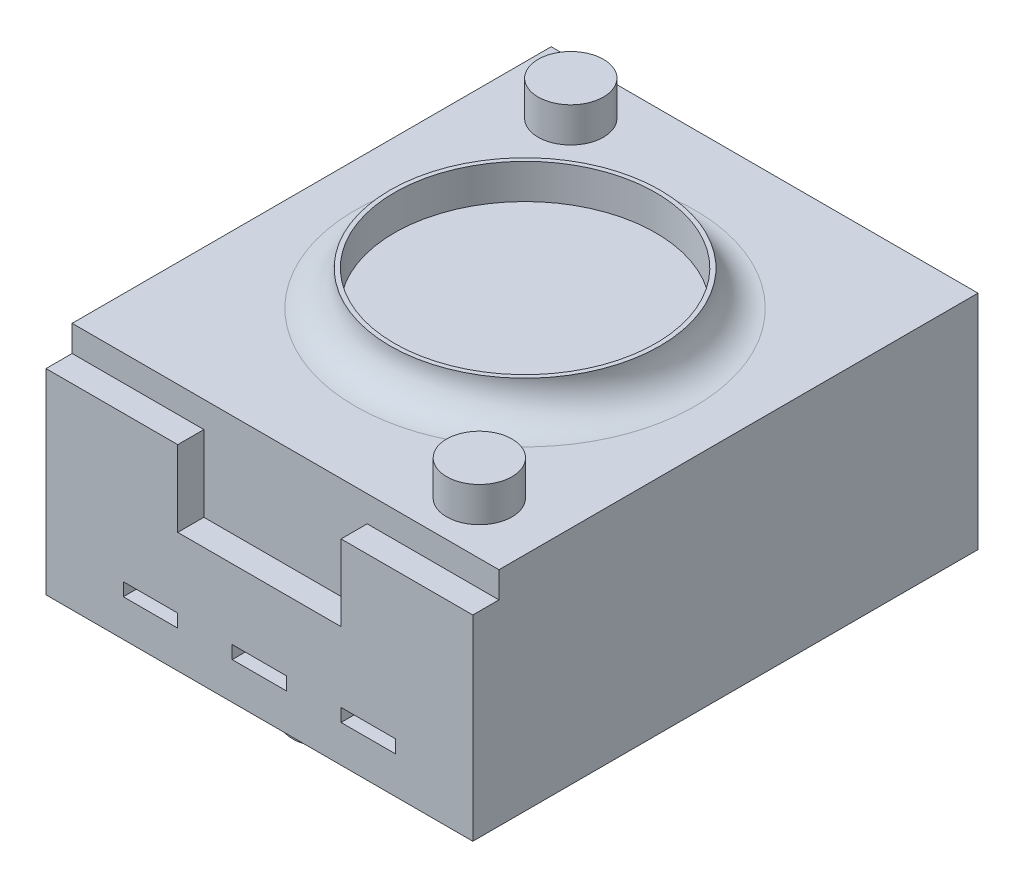
ISO-10303-21;
HEADER;
FILE_DESCRIPTION(('STEP AP214'),'2;1');
FILE_NAME('part.step','',(''),(''),'','','');
FILE_SCHEMA(('AUTOMOTIVE_DESIGN { 1 0 10303 214 1 1 1 1 }'));
ENDSEC;
DATA;
#1=APPLICATION_CONTEXT('core data for automotive mechanical design processes');
#2=APPLICATION_PROTOCOL_DEFINITION('international standard','automotive_design',2000,#1);
#3=PRODUCT_CONTEXT('',#1,'mechanical');
#4=PRODUCT('Part','Part','',(#3));
#5=PRODUCT_RELATED_PRODUCT_CATEGORY('part','',(#4));
#6=PRODUCT_DEFINITION_FORMATION('','',#4);
#7=PRODUCT_DEFINITION_CONTEXT('part definition',#1,'design');
#8=PRODUCT_DEFINITION('design','',#6,#7);
#9=PRODUCT_DEFINITION_SHAPE('','',#8);
#10=(LENGTH_UNIT() NAMED_UNIT(*) SI_UNIT(.MILLI.,.METRE.));
#11=(NAMED_UNIT(*) PLANE_ANGLE_UNIT() SI_UNIT($,.RADIAN.));
#12=(NAMED_UNIT(*) SI_UNIT($,.STERADIAN.) SOLID_ANGLE_UNIT());
#13=UNCERTAINTY_MEASURE_WITH_UNIT(LENGTH_MEASURE(1.E-05),#10,'distance_accuracy_value','');
#14=(GEOMETRIC_REPRESENTATION_CONTEXT(3) GLOBAL_UNCERTAINTY_ASSIGNED_CONTEXT((#13)) GLOBAL_UNIT_ASSIGNED_CONTEXT((#10,
#11,#12)) REPRESENTATION_CONTEXT('',''));
#15=CARTESIAN_POINT('',(0.,0.,0.));
#16=DIRECTION('',(0.,0.,1.));
#17=DIRECTION('',(1.,0.,0.));
#18=AXIS2_PLACEMENT_3D('',#15,#16,#17);
#19=CARTESIAN_POINT('',(0.,5.9,0.));
#20=DIRECTION('',(0.,1.,0.));
#21=DIRECTION('',(0.,0.,1.));
#22=AXIS2_PLACEMENT_3D('',#19,#20,#21);
#23=TOROIDAL_SURFACE('',#22,3.9,0.8);
#24=CARTESIAN_POINT('',(0.,5.9,3.1));
#25=CARTESIAN_POINT('',(0.,5.686130573478,3.1));
#26=CARTESIAN_POINT('',(0.,5.477833141934,3.168003480507));
#27=CARTESIAN_POINT('',(0.,5.29846438943801,3.298464389438));
#28=CARTESIAN_POINT('',(0.,5.16800348050701,3.477833141934));
#29=CARTESIAN_POINT('',(0.,5.1,3.686130573478));
#30=CARTESIAN_POINT('',(0.,5.1,3.9));
#31=(BOUNDED_CURVE() B_SPLINE_CURVE(6,(#24,#25,#26,#27,#28,#29,#30),.UNSPECIFIED.,.F.,
.F.) B_SPLINE_CURVE_WITH_KNOTS((7,7),(3.14159265359,4.712388980385),
.UNSPECIFIED.) CURVE() GEOMETRIC_REPRESENTATION_ITEM() RATIONAL_B_SPLINE_CURVE((1.031393471788,
1.010025407661,0.997924642725,0.993958444137,0.997924642725,1.010025407661,1.031393471788)) REPRESENTATION_ITEM(''));
#32=CARTESIAN_POINT('',(0.,5.9,3.1));
#33=VERTEX_POINT('',#32);
#34=CARTESIAN_POINT('',(0.,5.1,3.9));
#35=VERTEX_POINT('',#34);
#36=EDGE_CURVE('E11',#33,#35,#31,.T.);
#37=ORIENTED_EDGE('',*,*,#36,.F.);
#38=CARTESIAN_POINT('',(0.,5.9,0.));
#39=DIRECTION('',(0.,1.,0.));
#40=DIRECTION('',(0.,0.,1.));
#41=AXIS2_PLACEMENT_3D('',#38,#39,#40);
#42=CIRCLE('',#41,3.1);
#43=EDGE_CURVE('E612',#33,#33,#42,.T.);
#44=ORIENTED_EDGE('',*,*,#43,.F.);
#45=ORIENTED_EDGE('',*,*,#36,.T.);
#46=CARTESIAN_POINT('',(0.,5.1,0.));
#47=DIRECTION('',(0.,-1.,0.));
#48=DIRECTION('',(0.,0.,1.));
#49=AXIS2_PLACEMENT_3D('',#46,#47,#48);
#50=CIRCLE('',#49,3.9);
#51=EDGE_CURVE('E407',#35,#35,#50,.T.);
#52=ORIENTED_EDGE('',*,*,#51,.F.);
#53=EDGE_LOOP('',(#37,#44,#45,#52));
#54=FACE_BOUND('',#53,.T.);
#55=ADVANCED_FACE('F17',(#54),#23,.F.);
#56=CARTESIAN_POINT('',(0.,5.1,0.));
#57=DIRECTION('',(0.,1.,0.));
#58=DIRECTION('',(1.,0.,0.));
#59=AXIS2_PLACEMENT_3D('',#56,#57,#58);
#60=PLANE('',#59);
#61=CARTESIAN_POINT('',(0.,5.1,0.));
#62=DIRECTION('',(0.,-1.,0.));
#63=DIRECTION('',(0.,0.,1.));
#64=AXIS2_PLACEMENT_3D('',#61,#62,#63);
#65=CIRCLE('',#64,3.);
#66=CARTESIAN_POINT('',(0.,5.1,3.));
#67=VERTEX_POINT('',#66);
#68=EDGE_CURVE('E27',#67,#67,#65,.T.);
#69=ORIENTED_EDGE('',*,*,#68,.F.);
#70=EDGE_LOOP('',(#69));
#71=FACE_BOUND('',#70,.T.);
#72=ADVANCED_FACE('F19',(#71),#60,.T.);
#73=CARTESIAN_POINT('',(0.,5.9,0.));
#74=DIRECTION('',(0.,-1.,0.));
#75=DIRECTION('',(0.,0.,-1.));
#76=AXIS2_PLACEMENT_3D('',#73,#74,#75);
#77=CYLINDRICAL_SURFACE('',#76,3.);
#78=CARTESIAN_POINT('',(0.,5.9,3.));
#79=CARTESIAN_POINT('',(0.,5.1,3.));
#80=(BOUNDED_CURVE() B_SPLINE_CURVE(1,(#78,#79),.UNSPECIFIED.,.F.,
.F.) B_SPLINE_CURVE_WITH_KNOTS((2,2),(0.,0.8),
.UNSPECIFIED.) CURVE() GEOMETRIC_REPRESENTATION_ITEM() RATIONAL_B_SPLINE_CURVE((1.,1.)) REPRESENTATION_ITEM(''));
#81=CARTESIAN_POINT('',(0.,5.9,3.));
#82=VERTEX_POINT('',#81);
#83=EDGE_CURVE('E44',#82,#67,#80,.T.);
#84=ORIENTED_EDGE('',*,*,#83,.T.);
#85=ORIENTED_EDGE('',*,*,#68,.T.);
#86=ORIENTED_EDGE('',*,*,#83,.F.);
#87=CARTESIAN_POINT('',(0.,5.9,0.));
#88=DIRECTION('',(0.,1.,0.));
#89=DIRECTION('',(0.,0.,1.));
#90=AXIS2_PLACEMENT_3D('',#87,#88,#89);
#91=CIRCLE('',#90,3.);
#92=EDGE_CURVE('E21',#82,#82,#91,.T.);
#93=ORIENTED_EDGE('',*,*,#92,.T.);
#94=EDGE_LOOP('',(#84,#85,#86,#93));
#95=FACE_BOUND('',#94,.T.);
#96=ADVANCED_FACE('F622',(#95),#77,.F.);
#97=CARTESIAN_POINT('',(0.,5.9,0.));
#98=DIRECTION('',(0.,1.,0.));
#99=DIRECTION('',(1.,0.,0.));
#100=AXIS2_PLACEMENT_3D('',#97,#98,#99);
#101=PLANE('',#100);
#102=ORIENTED_EDGE('',*,*,#92,.F.);
#103=EDGE_LOOP('',(#102));
#104=FACE_BOUND('',#103,.T.);
#105=ORIENTED_EDGE('',*,*,#43,.T.);
#106=EDGE_LOOP('',(#105));
#107=FACE_BOUND('',#106,.T.);
#108=ADVANCED_FACE('F624',(#104,#107),#101,.T.);
#109=CARTESIAN_POINT('',(0.,-0.8,-4.045019339146));
#110=DIRECTION('',(0.,-1.,0.));
#111=DIRECTION('',(0.,0.,-1.));
#112=AXIS2_PLACEMENT_3D('',#109,#110,#111);
#113=PLANE('',#112);
#114=CARTESIAN_POINT('',(0.,-0.8,-4.045019339146));
#115=DIRECTION('',(0.,-1.,0.));
#116=DIRECTION('',(0.,0.,-1.));
#117=AXIS2_PLACEMENT_3D('',#114,#115,#116);
#118=CIRCLE('',#117,0.75);
#119=CARTESIAN_POINT('',(0.,-0.8,-4.795019339146));
#120=VERTEX_POINT('',#119);
#121=CARTESIAN_POINT('',(0.,-0.8,-3.295019339146));
#122=VERTEX_POINT('',#121);
#123=EDGE_CURVE('E607',#120,#122,#118,.T.);
#124=ORIENTED_EDGE('',*,*,#123,.T.);
#125=CARTESIAN_POINT('',(0.,-0.8,-4.045019339146));
#126=DIRECTION('',(0.,-1.,0.));
#127=DIRECTION('',(0.,0.,-1.));
#128=AXIS2_PLACEMENT_3D('',#125,#126,#127);
#129=CIRCLE('',#128,0.75);
#130=EDGE_CURVE('E424',#122,#120,#129,.T.);
#131=ORIENTED_EDGE('',*,*,#130,.T.);
#132=EDGE_LOOP('',(#124,#131));
#133=FACE_BOUND('',#132,.T.);
#134=ADVANCED_FACE('F626',(#133),#113,.T.);
#135=CARTESIAN_POINT('',(0.,-0.8,-4.045019339146));
#136=DIRECTION('',(0.,1.,0.));
#137=DIRECTION('',(0.,0.,1.));
#138=AXIS2_PLACEMENT_3D('',#135,#136,#137);
#139=CYLINDRICAL_SURFACE('',#138,0.75);
#140=ORIENTED_EDGE('',*,*,#130,.F.);
#141=CARTESIAN_POINT('',(0.,-0.8,-3.295019339146));
#142=CARTESIAN_POINT('',(0.,0.,-3.295019339146));
#143=(BOUNDED_CURVE() B_SPLINE_CURVE(1,(#141,#142),.UNSPECIFIED.,.F.,
.F.) B_SPLINE_CURVE_WITH_KNOTS((2,2),(0.,0.8),
.UNSPECIFIED.) CURVE() GEOMETRIC_REPRESENTATION_ITEM() RATIONAL_B_SPLINE_CURVE((1.,1.)) REPRESENTATION_ITEM(''));
#144=CARTESIAN_POINT('',(0.,0.,-3.295019339146));
#145=VERTEX_POINT('',#144);
#146=EDGE_CURVE('E428',#122,#145,#143,.T.);
#147=ORIENTED_EDGE('',*,*,#146,.T.);
#148=CARTESIAN_POINT('',(0.,0.,-4.045019339146));
#149=DIRECTION('',(0.,-1.,0.));
#150=DIRECTION('',(0.,0.,1.));
#151=AXIS2_PLACEMENT_3D('',#148,#149,#150);
#152=CIRCLE('',#151,0.75);
#153=EDGE_CURVE('E330',#145,#145,#152,.T.);
#154=ORIENTED_EDGE('',*,*,#153,.T.);
#155=ORIENTED_EDGE('',*,*,#146,.F.);
#156=ORIENTED_EDGE('',*,*,#123,.F.);
#157=EDGE_LOOP('',(#140,#147,#154,#155,#156));
#158=FACE_BOUND('',#157,.T.);
#159=ADVANCED_FACE('F634',(#158),#139,.T.);
#160=CARTESIAN_POINT('',(0.,-0.8,0.));
#161=DIRECTION('',(0.,-1.,0.));
#162=DIRECTION('',(0.,0.,-1.));
#163=AXIS2_PLACEMENT_3D('',#160,#161,#162);
#164=PLANE('',#163);
#165=CARTESIAN_POINT('',(0.,-0.8,4.584185637258));
#166=DIRECTION('',(0.,-1.,0.));
#167=DIRECTION('',(0.,0.,-1.));
#168=AXIS2_PLACEMENT_3D('',#165,#166,#167);
#169=CIRCLE('',#168,0.75);
#170=CARTESIAN_POINT('',(0.,-0.8,3.834185637258));
#171=VERTEX_POINT('',#170);
#172=CARTESIAN_POINT('',(0.,-0.8,5.334185637258));
#173=VERTEX_POINT('',#172);
#174=EDGE_CURVE('E429',#171,#173,#169,.T.);
#175=ORIENTED_EDGE('',*,*,#174,.T.);
#176=CARTESIAN_POINT('',(0.,-0.8,4.584185637258));
#177=DIRECTION('',(0.,-1.,0.));
#178=DIRECTION('',(0.,0.,-1.));
#179=AXIS2_PLACEMENT_3D('',#176,#177,#178);
#180=CIRCLE('',#179,0.75);
#181=EDGE_CURVE('E587',#173,#171,#180,.T.);
#182=ORIENTED_EDGE('',*,*,#181,.T.);
#183=EDGE_LOOP('',(#175,#182));
#184=FACE_BOUND('',#183,.T.);
#185=ADVANCED_FACE('F697',(#184),#164,.T.);
#186=CARTESIAN_POINT('',(0.,-0.8,4.584185637258));
#187=DIRECTION('',(0.,1.,0.));
#188=DIRECTION('',(0.,0.,1.));
#189=AXIS2_PLACEMENT_3D('',#186,#187,#188);
#190=CYLINDRICAL_SURFACE('',#189,0.75);
#191=ORIENTED_EDGE('',*,*,#181,.F.);
#192=CARTESIAN_POINT('',(0.,-0.8,5.334185637258));
#193=CARTESIAN_POINT('',(0.,0.,5.334185637258));
#194=(BOUNDED_CURVE() B_SPLINE_CURVE(1,(#192,#193),.UNSPECIFIED.,.F.,
.F.) B_SPLINE_CURVE_WITH_KNOTS((2,2),(0.,0.8),
.UNSPECIFIED.) CURVE() GEOMETRIC_REPRESENTATION_ITEM() RATIONAL_B_SPLINE_CURVE((1.,1.)) REPRESENTATION_ITEM(''));
#195=CARTESIAN_POINT('',(0.,0.,5.334185637258));
#196=VERTEX_POINT('',#195);
#197=EDGE_CURVE('E591',#173,#196,#194,.T.);
#198=ORIENTED_EDGE('',*,*,#197,.T.);
#199=CARTESIAN_POINT('',(0.,0.,4.584185637258));
#200=DIRECTION('',(0.,-1.,0.));
#201=DIRECTION('',(0.,0.,1.));
#202=AXIS2_PLACEMENT_3D('',#199,#200,#201);
#203=CIRCLE('',#202,0.75);
#204=EDGE_CURVE('E439',#196,#196,#203,.T.);
#205=ORIENTED_EDGE('',*,*,#204,.T.);
#206=ORIENTED_EDGE('',*,*,#197,.F.);
#207=ORIENTED_EDGE('',*,*,#174,.F.);
#208=EDGE_LOOP('',(#191,#198,#205,#206,#207));
#209=FACE_BOUND('',#208,.T.);
#210=ADVANCED_FACE('F692',(#209),#190,.T.);
#211=CARTESIAN_POINT('',(-4.9,5.1,5.5));
#212=DIRECTION('',(0.,0.,-1.));
#213=DIRECTION('',(0.,-1.,0.));
#214=AXIS2_PLACEMENT_3D('',#211,#212,#213);
#215=PLANE('',#214);
#216=DIRECTION('',(0.,1.,0.));
#217=VECTOR('',#216,1.);
#218=CARTESIAN_POINT('',(3.125,1.15,5.5));
#219=LINE('',#218,#217);
#220=CARTESIAN_POINT('',(3.125,0.85,5.5));
#221=VERTEX_POINT('',#220);
#222=CARTESIAN_POINT('',(3.125,1.15,5.5));
#223=VERTEX_POINT('',#222);
#224=EDGE_CURVE('E411',#221,#223,#219,.T.);
#225=ORIENTED_EDGE('',*,*,#224,.T.);
#226=DIRECTION('',(-1.,0.,0.));
#227=VECTOR('',#226,1.);
#228=CARTESIAN_POINT('',(1.875,1.15,5.5));
#229=LINE('',#228,#227);
#230=CARTESIAN_POINT('',(1.875,1.15,5.5));
#231=VERTEX_POINT('',#230);
#232=EDGE_CURVE('E584',#223,#231,#229,.T.);
#233=ORIENTED_EDGE('',*,*,#232,.T.);
#234=DIRECTION('',(0.,-1.,0.));
#235=VECTOR('',#234,1.);
#236=CARTESIAN_POINT('',(1.875,1.15,5.5));
#237=LINE('',#236,#235);
#238=CARTESIAN_POINT('',(1.875,0.85,5.5));
#239=VERTEX_POINT('',#238);
#240=EDGE_CURVE('E570',#231,#239,#237,.T.);
#241=ORIENTED_EDGE('',*,*,#240,.T.);
#242=DIRECTION('',(1.,0.,0.));
#243=VECTOR('',#242,1.);
#244=CARTESIAN_POINT('',(1.875,0.85,5.5));
#245=LINE('',#244,#243);
#246=EDGE_CURVE('E420',#239,#221,#245,.T.);
#247=ORIENTED_EDGE('',*,*,#246,.T.);
#248=EDGE_LOOP('',(#225,#233,#241,#247));
#249=FACE_BOUND('',#248,.T.);
#250=ADVANCED_FACE('F688',(#249),#215,.F.);
#251=CARTESIAN_POINT('',(-4.9,5.1,5.5));
#252=DIRECTION('',(0.,0.,-1.));
#253=DIRECTION('',(0.,-1.,0.));
#254=AXIS2_PLACEMENT_3D('',#251,#252,#253);
#255=PLANE('',#254);
#256=DIRECTION('',(0.,1.,0.));
#257=VECTOR('',#256,1.);
#258=CARTESIAN_POINT('',(-1.875,1.15,5.5));
#259=LINE('',#258,#257);
#260=CARTESIAN_POINT('',(-1.875,0.85,5.5));
#261=VERTEX_POINT('',#260);
#262=CARTESIAN_POINT('',(-1.875,1.15,5.5));
#263=VERTEX_POINT('',#262);
#264=EDGE_CURVE('E550',#261,#263,#259,.T.);
#265=ORIENTED_EDGE('',*,*,#264,.T.);
#266=DIRECTION('',(-1.,0.,0.));
#267=VECTOR('',#266,1.);
#268=CARTESIAN_POINT('',(-3.125,1.15,5.5));
#269=LINE('',#268,#267);
#270=CARTESIAN_POINT('',(-3.125,1.15,5.5));
#271=VERTEX_POINT('',#270);
#272=EDGE_CURVE('E474',#263,#271,#269,.T.);
#273=ORIENTED_EDGE('',*,*,#272,.T.);
#274=DIRECTION('',(0.,-1.,0.));
#275=VECTOR('',#274,1.);
#276=CARTESIAN_POINT('',(-3.125,1.15,5.5));
#277=LINE('',#276,#275);
#278=CARTESIAN_POINT('',(-3.125,0.85,5.5));
#279=VERTEX_POINT('',#278);
#280=EDGE_CURVE('E349',#271,#279,#277,.T.);
#281=ORIENTED_EDGE('',*,*,#280,.T.);
#282=DIRECTION('',(1.,0.,0.));
#283=VECTOR('',#282,1.);
#284=CARTESIAN_POINT('',(-3.125,0.85,5.5));
#285=LINE('',#284,#283);
#286=EDGE_CURVE('E344',#279,#261,#285,.T.);
#287=ORIENTED_EDGE('',*,*,#286,.T.);
#288=EDGE_LOOP('',(#265,#273,#281,#287));
#289=FACE_BOUND('',#288,.T.);
#290=ADVANCED_FACE('F691',(#289),#255,.F.);
#291=CARTESIAN_POINT('',(-4.9,5.1,5.5));
#292=DIRECTION('',(0.,0.,-1.));
#293=DIRECTION('',(0.,-1.,0.));
#294=AXIS2_PLACEMENT_3D('',#291,#292,#293);
#295=PLANE('',#294);
#296=DIRECTION('',(0.,-1.,0.));
#297=VECTOR('',#296,1.);
#298=CARTESIAN_POINT('',(-0.625,0.85,5.5));
#299=LINE('',#298,#297);
#300=CARTESIAN_POINT('',(-0.625,1.15,5.5));
#301=VERTEX_POINT('',#300);
#302=CARTESIAN_POINT('',(-0.625,0.85,5.5));
#303=VERTEX_POINT('',#302);
#304=EDGE_CURVE('E520',#301,#303,#299,.T.);
#305=ORIENTED_EDGE('',*,*,#304,.T.);
#306=DIRECTION('',(1.,0.,0.));
#307=VECTOR('',#306,1.);
#308=CARTESIAN_POINT('',(0.625,0.85,5.5));
#309=LINE('',#308,#307);
#310=CARTESIAN_POINT('',(0.625,0.85,5.5));
#311=VERTEX_POINT('',#310);
#312=EDGE_CURVE('E567',#303,#311,#309,.T.);
#313=ORIENTED_EDGE('',*,*,#312,.T.);
#314=DIRECTION('',(0.,1.,0.));
#315=VECTOR('',#314,1.);
#316=CARTESIAN_POINT('',(0.625,0.85,5.5));
#317=LINE('',#316,#315);
#318=CARTESIAN_POINT('',(0.625,1.15,5.5));
#319=VERTEX_POINT('',#318);
#320=EDGE_CURVE('E365',#311,#319,#317,.T.);
#321=ORIENTED_EDGE('',*,*,#320,.T.);
#322=DIRECTION('',(-1.,0.,0.));
#323=VECTOR('',#322,1.);
#324=CARTESIAN_POINT('',(0.625,1.15,5.5));
#325=LINE('',#324,#323);
#326=EDGE_CURVE('E526',#319,#301,#325,.T.);
#327=ORIENTED_EDGE('',*,*,#326,.T.);
#328=EDGE_LOOP('',(#305,#313,#321,#327));
#329=FACE_BOUND('',#328,.T.);
#330=ADVANCED_FACE('F686',(#329),#295,.F.);
#331=CARTESIAN_POINT('',(1.875,1.15,6.1));
#332=DIRECTION('',(0.,-1.,0.));
#333=DIRECTION('',(0.,0.,-1.));
#334=AXIS2_PLACEMENT_3D('',#331,#332,#333);
#335=PLANE('',#334);
#336=ORIENTED_EDGE('',*,*,#232,.F.);
#337=DIRECTION('',(0.,0.,-1.));
#338=VECTOR('',#337,1.);
#339=CARTESIAN_POINT('',(3.125,1.15,6.1));
#340=LINE('',#339,#338);
#341=CARTESIAN_POINT('',(3.125,1.15,6.1));
#342=VERTEX_POINT('',#341);
#343=EDGE_CURVE('E415',#342,#223,#340,.T.);
#344=ORIENTED_EDGE('',*,*,#343,.F.);
#345=DIRECTION('',(-1.,0.,0.));
#346=VECTOR('',#345,1.);
#347=CARTESIAN_POINT('',(1.875,1.15,6.1));
#348=LINE('',#347,#346);
#349=CARTESIAN_POINT('',(1.875,1.15,6.1));
#350=VERTEX_POINT('',#349);
#351=EDGE_CURVE('E435',#342,#350,#348,.T.);
#352=ORIENTED_EDGE('',*,*,#351,.T.);
#353=DIRECTION('',(0.,0.,-1.));
#354=VECTOR('',#353,1.);
#355=CARTESIAN_POINT('',(1.875,1.15,6.1));
#356=LINE('',#355,#354);
#357=EDGE_CURVE('E574',#350,#231,#356,.T.);
#358=ORIENTED_EDGE('',*,*,#357,.T.);
#359=EDGE_LOOP('',(#336,#344,#352,#358));
#360=FACE_BOUND('',#359,.T.);
#361=ADVANCED_FACE('F682',(#360),#335,.T.);
#362=CARTESIAN_POINT('',(3.125,1.15,6.1));
#363=DIRECTION('',(-1.,0.,0.));
#364=DIRECTION('',(0.,0.,1.));
#365=AXIS2_PLACEMENT_3D('',#362,#363,#364);
#366=PLANE('',#365);
#367=ORIENTED_EDGE('',*,*,#224,.F.);
#368=DIRECTION('',(0.,0.,-1.));
#369=VECTOR('',#368,1.);
#370=CARTESIAN_POINT('',(3.125,0.85,6.1));
#371=LINE('',#370,#369);
#372=CARTESIAN_POINT('',(3.125,0.85,6.1));
#373=VERTEX_POINT('',#372);
#374=EDGE_CURVE('E416',#373,#221,#371,.T.);
#375=ORIENTED_EDGE('',*,*,#374,.F.);
#376=DIRECTION('',(0.,1.,0.));
#377=VECTOR('',#376,1.);
#378=CARTESIAN_POINT('',(3.125,1.15,6.1));
#379=LINE('',#378,#377);
#380=EDGE_CURVE('E430',#373,#342,#379,.T.);
#381=ORIENTED_EDGE('',*,*,#380,.T.);
#382=ORIENTED_EDGE('',*,*,#343,.T.);
#383=EDGE_LOOP('',(#367,#375,#381,#382));
#384=FACE_BOUND('',#383,.T.);
#385=ADVANCED_FACE('F678',(#384),#366,.T.);
#386=CARTESIAN_POINT('',(1.875,0.85,6.1));
#387=DIRECTION('',(0.,1.,0.));
#388=DIRECTION('',(1.,0.,0.));
#389=AXIS2_PLACEMENT_3D('',#386,#387,#388);
#390=PLANE('',#389);
#391=ORIENTED_EDGE('',*,*,#246,.F.);
#392=DIRECTION('',(0.,0.,-1.));
#393=VECTOR('',#392,1.);
#394=CARTESIAN_POINT('',(1.875,0.85,6.1));
#395=LINE('',#394,#393);
#396=CARTESIAN_POINT('',(1.875,0.85,6.1));
#397=VERTEX_POINT('',#396);
#398=EDGE_CURVE('E486',#397,#239,#395,.T.);
#399=ORIENTED_EDGE('',*,*,#398,.F.);
#400=DIRECTION('',(1.,0.,0.));
#401=VECTOR('',#400,1.);
#402=CARTESIAN_POINT('',(1.875,0.85,6.1));
#403=LINE('',#402,#401);
#404=EDGE_CURVE('E434',#397,#373,#403,.T.);
#405=ORIENTED_EDGE('',*,*,#404,.T.);
#406=ORIENTED_EDGE('',*,*,#374,.T.);
#407=EDGE_LOOP('',(#391,#399,#405,#406));
#408=FACE_BOUND('',#407,.T.);
#409=ADVANCED_FACE('F675',(#408),#390,.T.);
#410=CARTESIAN_POINT('',(1.875,1.15,6.1));
#411=DIRECTION('',(1.,0.,0.));
#412=DIRECTION('',(0.,1.,0.));
#413=AXIS2_PLACEMENT_3D('',#410,#411,#412);
#414=PLANE('',#413);
#415=ORIENTED_EDGE('',*,*,#240,.F.);
#416=ORIENTED_EDGE('',*,*,#357,.F.);
#417=DIRECTION('',(0.,-1.,0.));
#418=VECTOR('',#417,1.);
#419=CARTESIAN_POINT('',(1.875,1.15,6.1));
#420=LINE('',#419,#418);
#421=EDGE_CURVE('E502',#350,#397,#420,.T.);
#422=ORIENTED_EDGE('',*,*,#421,.T.);
#423=ORIENTED_EDGE('',*,*,#398,.T.);
#424=EDGE_LOOP('',(#415,#416,#422,#423));
#425=FACE_BOUND('',#424,.T.);
#426=ADVANCED_FACE('F667',(#425),#414,.T.);
#427=CARTESIAN_POINT('',(0.625,0.85,6.1));
#428=DIRECTION('',(0.,1.,0.));
#429=DIRECTION('',(1.,0.,0.));
#430=AXIS2_PLACEMENT_3D('',#427,#428,#429);
#431=PLANE('',#430);
#432=ORIENTED_EDGE('',*,*,#312,.F.);
#433=DIRECTION('',(0.,0.,-1.));
#434=VECTOR('',#433,1.);
#435=CARTESIAN_POINT('',(-0.625,0.85,6.1));
#436=LINE('',#435,#434);
#437=CARTESIAN_POINT('',(-0.625,0.85,6.1));
#438=VERTEX_POINT('',#437);
#439=EDGE_CURVE('E524',#438,#303,#436,.T.);
#440=ORIENTED_EDGE('',*,*,#439,.F.);
#441=DIRECTION('',(1.,0.,0.));
#442=VECTOR('',#441,1.);
#443=CARTESIAN_POINT('',(0.625,0.85,6.1));
#444=LINE('',#443,#442);
#445=CARTESIAN_POINT('',(0.625,0.85,6.1));
#446=VERTEX_POINT('',#445);
#447=EDGE_CURVE('E447',#438,#446,#444,.T.);
#448=ORIENTED_EDGE('',*,*,#447,.T.);
#449=DIRECTION('',(0.,0.,-1.));
#450=VECTOR('',#449,1.);
#451=CARTESIAN_POINT('',(0.625,0.85,6.1));
#452=LINE('',#451,#450);
#453=EDGE_CURVE('E360',#446,#311,#452,.T.);
#454=ORIENTED_EDGE('',*,*,#453,.T.);
#455=EDGE_LOOP('',(#432,#440,#448,#454));
#456=FACE_BOUND('',#455,.T.);
#457=ADVANCED_FACE('F663',(#456),#431,.T.);
#458=CARTESIAN_POINT('',(-0.625,0.85,6.1));
#459=DIRECTION('',(1.,0.,0.));
#460=DIRECTION('',(0.,1.,0.));
#461=AXIS2_PLACEMENT_3D('',#458,#459,#460);
#462=PLANE('',#461);
#463=ORIENTED_EDGE('',*,*,#304,.F.);
#464=DIRECTION('',(0.,0.,-1.));
#465=VECTOR('',#464,1.);
#466=CARTESIAN_POINT('',(-0.625,1.15,6.1));
#467=LINE('',#466,#465);
#468=CARTESIAN_POINT('',(-0.625,1.15,6.1));
#469=VERTEX_POINT('',#468);
#470=EDGE_CURVE('E525',#469,#301,#467,.T.);
#471=ORIENTED_EDGE('',*,*,#470,.F.);
#472=DIRECTION('',(0.,-1.,0.));
#473=VECTOR('',#472,1.);
#474=CARTESIAN_POINT('',(-0.625,0.85,6.1));
#475=LINE('',#474,#473);
#476=EDGE_CURVE('E460',#469,#438,#475,.T.);
#477=ORIENTED_EDGE('',*,*,#476,.T.);
#478=ORIENTED_EDGE('',*,*,#439,.T.);
#479=EDGE_LOOP('',(#463,#471,#477,#478));
#480=FACE_BOUND('',#479,.T.);
#481=ADVANCED_FACE('F666',(#480),#462,.T.);
#482=CARTESIAN_POINT('',(0.625,1.15,6.1));
#483=DIRECTION('',(0.,-1.,0.));
#484=DIRECTION('',(0.,0.,-1.));
#485=AXIS2_PLACEMENT_3D('',#482,#483,#484);
#486=PLANE('',#485);
#487=ORIENTED_EDGE('',*,*,#326,.F.);
#488=DIRECTION('',(0.,0.,-1.));
#489=VECTOR('',#488,1.);
#490=CARTESIAN_POINT('',(0.625,1.15,6.1));
#491=LINE('',#490,#489);
#492=CARTESIAN_POINT('',(0.625,1.15,6.1));
#493=VERTEX_POINT('',#492);
#494=EDGE_CURVE('E364',#493,#319,#491,.T.);
#495=ORIENTED_EDGE('',*,*,#494,.F.);
#496=DIRECTION('',(-1.,0.,0.));
#497=VECTOR('',#496,1.);
#498=CARTESIAN_POINT('',(0.625,1.15,6.1));
#499=LINE('',#498,#497);
#500=EDGE_CURVE('E464',#493,#469,#499,.T.);
#501=ORIENTED_EDGE('',*,*,#500,.T.);
#502=ORIENTED_EDGE('',*,*,#470,.T.);
#503=EDGE_LOOP('',(#487,#495,#501,#502));
#504=FACE_BOUND('',#503,.T.);
#505=ADVANCED_FACE('F661',(#504),#486,.T.);
#506=CARTESIAN_POINT('',(0.625,0.85,6.1));
#507=DIRECTION('',(-1.,0.,0.));
#508=DIRECTION('',(0.,0.,1.));
#509=AXIS2_PLACEMENT_3D('',#506,#507,#508);
#510=PLANE('',#509);
#511=ORIENTED_EDGE('',*,*,#320,.F.);
#512=ORIENTED_EDGE('',*,*,#453,.F.);
#513=DIRECTION('',(0.,1.,0.));
#514=VECTOR('',#513,1.);
#515=CARTESIAN_POINT('',(0.625,0.85,6.1));
#516=LINE('',#515,#514);
#517=EDGE_CURVE('E443',#446,#493,#516,.T.);
#518=ORIENTED_EDGE('',*,*,#517,.T.);
#519=ORIENTED_EDGE('',*,*,#494,.T.);
#520=EDGE_LOOP('',(#511,#512,#518,#519));
#521=FACE_BOUND('',#520,.T.);
#522=ADVANCED_FACE('F657',(#521),#510,.T.);
#523=CARTESIAN_POINT('',(-3.125,1.15,6.1));
#524=DIRECTION('',(0.,-1.,0.));
#525=DIRECTION('',(0.,0.,-1.));
#526=AXIS2_PLACEMENT_3D('',#523,#524,#525);
#527=PLANE('',#526);
#528=ORIENTED_EDGE('',*,*,#272,.F.);
#529=DIRECTION('',(0.,0.,-1.));
#530=VECTOR('',#529,1.);
#531=CARTESIAN_POINT('',(-1.875,1.15,6.1));
#532=LINE('',#531,#530);
#533=CARTESIAN_POINT('',(-1.875,1.15,6.1));
#534=VERTEX_POINT('',#533);
#535=EDGE_CURVE('E551',#534,#263,#532,.T.);
#536=ORIENTED_EDGE('',*,*,#535,.F.);
#537=DIRECTION('',(-1.,0.,0.));
#538=VECTOR('',#537,1.);
#539=CARTESIAN_POINT('',(-3.125,1.15,6.1));
#540=LINE('',#539,#538);
#541=CARTESIAN_POINT('',(-3.125,1.15,6.1));
#542=VERTEX_POINT('',#541);
#543=EDGE_CURVE('E490',#534,#542,#540,.T.);
#544=ORIENTED_EDGE('',*,*,#543,.T.);
#545=DIRECTION('',(0.,0.,-1.));
#546=VECTOR('',#545,1.);
#547=CARTESIAN_POINT('',(-3.125,1.15,6.1));
#548=LINE('',#547,#546);
#549=EDGE_CURVE('E345',#542,#271,#548,.T.);
#550=ORIENTED_EDGE('',*,*,#549,.T.);
#551=EDGE_LOOP('',(#528,#536,#544,#550));
#552=FACE_BOUND('',#551,.T.);
#553=ADVANCED_FACE('F653',(#552),#527,.T.);
#554=CARTESIAN_POINT('',(-1.875,1.15,6.1));
#555=DIRECTION('',(-1.,0.,0.));
#556=DIRECTION('',(0.,1.,0.));
#557=AXIS2_PLACEMENT_3D('',#554,#555,#556);
#558=PLANE('',#557);
#559=ORIENTED_EDGE('',*,*,#264,.F.);
#560=DIRECTION('',(0.,0.,-1.));
#561=VECTOR('',#560,1.);
#562=CARTESIAN_POINT('',(-1.875,0.85,6.1));
#563=LINE('',#562,#561);
#564=CARTESIAN_POINT('',(-1.875,0.85,6.1));
#565=VERTEX_POINT('',#564);
#566=EDGE_CURVE('E516',#565,#261,#563,.T.);
#567=ORIENTED_EDGE('',*,*,#566,.F.);
#568=DIRECTION('',(0.,1.,0.));
#569=VECTOR('',#568,1.);
#570=CARTESIAN_POINT('',(-1.875,1.15,6.1));
#571=LINE('',#570,#569);
#572=EDGE_CURVE('E494',#565,#534,#571,.T.);
#573=ORIENTED_EDGE('',*,*,#572,.T.);
#574=ORIENTED_EDGE('',*,*,#535,.T.);
#575=EDGE_LOOP('',(#559,#567,#573,#574));
#576=FACE_BOUND('',#575,.T.);
#577=ADVANCED_FACE('F650',(#576),#558,.T.);
#578=CARTESIAN_POINT('',(-3.125,0.85,6.1));
#579=DIRECTION('',(0.,1.,0.));
#580=DIRECTION('',(1.,0.,0.));
#581=AXIS2_PLACEMENT_3D('',#578,#579,#580);
#582=PLANE('',#581);
#583=ORIENTED_EDGE('',*,*,#286,.F.);
#584=DIRECTION('',(0.,0.,-1.));
#585=VECTOR('',#584,1.);
#586=CARTESIAN_POINT('',(-3.125,0.85,6.1));
#587=LINE('',#586,#585);
#588=CARTESIAN_POINT('',(-3.125,0.85,6.1));
#589=VERTEX_POINT('',#588);
#590=EDGE_CURVE('E340',#589,#279,#587,.T.);
#591=ORIENTED_EDGE('',*,*,#590,.F.);
#592=DIRECTION('',(1.,0.,0.));
#593=VECTOR('',#592,1.);
#594=CARTESIAN_POINT('',(-3.125,0.85,6.1));
#595=LINE('',#594,#593);
#596=EDGE_CURVE('E498',#589,#565,#595,.T.);
#597=ORIENTED_EDGE('',*,*,#596,.T.);
#598=ORIENTED_EDGE('',*,*,#566,.T.);
#599=EDGE_LOOP('',(#583,#591,#597,#598));
#600=FACE_BOUND('',#599,.T.);
#601=ADVANCED_FACE('F648',(#600),#582,.T.);
#602=CARTESIAN_POINT('',(-3.125,1.15,6.1));
#603=DIRECTION('',(1.,0.,0.));
#604=DIRECTION('',(0.,1.,0.));
#605=AXIS2_PLACEMENT_3D('',#602,#603,#604);
#606=PLANE('',#605);
#607=ORIENTED_EDGE('',*,*,#280,.F.);
#608=ORIENTED_EDGE('',*,*,#549,.F.);
#609=DIRECTION('',(0.,-1.,0.));
#610=VECTOR('',#609,1.);
#611=CARTESIAN_POINT('',(-3.125,1.15,6.1));
#612=LINE('',#611,#610);
#613=EDGE_CURVE('E481',#542,#589,#612,.T.);
#614=ORIENTED_EDGE('',*,*,#613,.T.);
#615=ORIENTED_EDGE('',*,*,#590,.T.);
#616=EDGE_LOOP('',(#607,#608,#614,#615));
#617=FACE_BOUND('',#616,.T.);
#618=ADVANCED_FACE('F758',(#617),#606,.T.);
#619=CARTESIAN_POINT('',(-4.9,4.5,6.1));
#620=DIRECTION('',(0.,-1.,0.));
#621=DIRECTION('',(0.,0.,-1.));
#622=AXIS2_PLACEMENT_3D('',#619,#620,#621);
#623=PLANE('',#622);
#624=DIRECTION('',(-1.,0.,0.));
#625=VECTOR('',#624,1.);
#626=CARTESIAN_POINT('',(-4.9,4.5,5.5));
#627=LINE('',#626,#625);
#628=CARTESIAN_POINT('',(-1.875,4.5,5.5));
#629=VERTEX_POINT('',#628);
#630=CARTESIAN_POINT('',(-4.9,4.5,5.5));
#631=VERTEX_POINT('',#630);
#632=EDGE_CURVE('E317',#629,#631,#627,.T.);
#633=ORIENTED_EDGE('',*,*,#632,.T.);
#634=DIRECTION('',(0.,0.,-1.));
#635=VECTOR('',#634,1.);
#636=CARTESIAN_POINT('',(-4.9,4.5,6.1));
#637=LINE('',#636,#635);
#638=CARTESIAN_POINT('',(-4.9,4.5,6.1));
#639=VERTEX_POINT('',#638);
#640=EDGE_CURVE('E394',#639,#631,#637,.T.);
#641=ORIENTED_EDGE('',*,*,#640,.F.);
#642=DIRECTION('',(-1.,0.,0.));
#643=VECTOR('',#642,1.);
#644=CARTESIAN_POINT('',(-4.9,4.5,6.1));
#645=LINE('',#644,#643);
#646=CARTESIAN_POINT('',(-1.875,4.5,6.1));
#647=VERTEX_POINT('',#646);
#648=EDGE_CURVE('E478',#647,#639,#645,.T.);
#649=ORIENTED_EDGE('',*,*,#648,.F.);
#650=DIRECTION('',(0.,0.,-1.));
#651=VECTOR('',#650,1.);
#652=CARTESIAN_POINT('',(-1.875,4.5,6.1));
#653=LINE('',#652,#651);
#654=EDGE_CURVE('E353',#647,#629,#653,.T.);
#655=ORIENTED_EDGE('',*,*,#654,.T.);
#656=EDGE_LOOP('',(#633,#641,#649,#655));
#657=FACE_BOUND('',#656,.T.);
#658=ADVANCED_FACE('F755',(#657),#623,.F.);
#659=CARTESIAN_POINT('',(-1.875,2.755408920368,6.1));
#660=DIRECTION('',(-1.,0.,0.));
#661=DIRECTION('',(0.,0.,1.));
#662=AXIS2_PLACEMENT_3D('',#659,#660,#661);
#663=PLANE('',#662);
#664=DIRECTION('',(0.,1.,0.));
#665=VECTOR('',#664,1.);
#666=CARTESIAN_POINT('',(-1.875,2.755408920368,5.5));
#667=LINE('',#666,#665);
#668=CARTESIAN_POINT('',(-1.875,2.755408920368,5.5));
#669=VERTEX_POINT('',#668);
#670=EDGE_CURVE('E314',#669,#629,#667,.T.);
#671=ORIENTED_EDGE('',*,*,#670,.T.);
#672=ORIENTED_EDGE('',*,*,#654,.F.);
#673=DIRECTION('',(0.,1.,0.));
#674=VECTOR('',#673,1.);
#675=CARTESIAN_POINT('',(-1.875,2.755408920368,6.1));
#676=LINE('',#675,#674);
#677=CARTESIAN_POINT('',(-1.875,2.755408920368,6.1));
#678=VERTEX_POINT('',#677);
#679=EDGE_CURVE('E482',#678,#647,#676,.T.);
#680=ORIENTED_EDGE('',*,*,#679,.F.);
#681=DIRECTION('',(0.,0.,-1.));
#682=VECTOR('',#681,1.);
#683=CARTESIAN_POINT('',(-1.875,2.755408920368,6.1));
#684=LINE('',#683,#682);
#685=EDGE_CURVE('E539',#678,#669,#684,.T.);
#686=ORIENTED_EDGE('',*,*,#685,.T.);
#687=EDGE_LOOP('',(#671,#672,#680,#686));
#688=FACE_BOUND('',#687,.T.);
#689=ADVANCED_FACE('F753',(#688),#663,.F.);
#690=CARTESIAN_POINT('',(-1.875,2.755408920368,6.1));
#691=DIRECTION('',(0.,-1.,0.));
#692=DIRECTION('',(0.,0.,-1.));
#693=AXIS2_PLACEMENT_3D('',#690,#691,#692);
#694=PLANE('',#693);
#695=DIRECTION('',(-1.,0.,0.));
#696=VECTOR('',#695,1.);
#697=CARTESIAN_POINT('',(-1.875,2.755408920368,5.5));
#698=LINE('',#697,#696);
#699=CARTESIAN_POINT('',(1.875,2.755408920368,5.5));
#700=VERTEX_POINT('',#699);
#701=EDGE_CURVE('E308',#700,#669,#698,.T.);
#702=ORIENTED_EDGE('',*,*,#701,.T.);
#703=ORIENTED_EDGE('',*,*,#685,.F.);
#704=DIRECTION('',(-1.,0.,0.));
#705=VECTOR('',#704,1.);
#706=CARTESIAN_POINT('',(-1.875,2.755408920368,6.1));
#707=LINE('',#706,#705);
#708=CARTESIAN_POINT('',(1.875,2.755408920368,6.1));
#709=VERTEX_POINT('',#708);
#710=EDGE_CURVE('E312',#709,#678,#707,.T.);
#711=ORIENTED_EDGE('',*,*,#710,.F.);
#712=DIRECTION('',(0.,0.,-1.));
#713=VECTOR('',#712,1.);
#714=CARTESIAN_POINT('',(1.875,2.755408920368,6.1));
#715=LINE('',#714,#713);
#716=EDGE_CURVE('E536',#709,#700,#715,.T.);
#717=ORIENTED_EDGE('',*,*,#716,.T.);
#718=EDGE_LOOP('',(#702,#703,#711,#717));
#719=FACE_BOUND('',#718,.T.);
#720=ADVANCED_FACE('F749',(#719),#694,.F.);
#721=CARTESIAN_POINT('',(1.875,2.755408920368,6.1));
#722=DIRECTION('',(1.,0.,0.));
#723=DIRECTION('',(0.,1.,0.));
#724=AXIS2_PLACEMENT_3D('',#721,#722,#723);
#725=PLANE('',#724);
#726=DIRECTION('',(0.,-1.,0.));
#727=VECTOR('',#726,1.);
#728=CARTESIAN_POINT('',(1.875,2.755408920368,5.5));
#729=LINE('',#728,#727);
#730=CARTESIAN_POINT('',(1.875,4.5,5.5));
#731=VERTEX_POINT('',#730);
#732=EDGE_CURVE('E301',#731,#700,#729,.T.);
#733=ORIENTED_EDGE('',*,*,#732,.T.);
#734=ORIENTED_EDGE('',*,*,#716,.F.);
#735=DIRECTION('',(0.,-1.,0.));
#736=VECTOR('',#735,1.);
#737=CARTESIAN_POINT('',(1.875,2.755408920368,6.1));
#738=LINE('',#737,#736);
#739=CARTESIAN_POINT('',(1.875,4.5,6.1));
#740=VERTEX_POINT('',#739);
#741=EDGE_CURVE('E470',#740,#709,#738,.T.);
#742=ORIENTED_EDGE('',*,*,#741,.F.);
#743=DIRECTION('',(0.,0.,-1.));
#744=VECTOR('',#743,1.);
#745=CARTESIAN_POINT('',(1.875,4.5,6.1));
#746=LINE('',#745,#744);
#747=EDGE_CURVE('E533',#740,#731,#746,.T.);
#748=ORIENTED_EDGE('',*,*,#747,.T.);
#749=EDGE_LOOP('',(#733,#734,#742,#748));
#750=FACE_BOUND('',#749,.T.);
#751=ADVANCED_FACE('F752',(#750),#725,.F.);
#752=CARTESIAN_POINT('',(1.875,4.5,6.1));
#753=DIRECTION('',(0.,-1.,0.));
#754=DIRECTION('',(0.,0.,-1.));
#755=AXIS2_PLACEMENT_3D('',#752,#753,#754);
#756=PLANE('',#755);
#757=DIRECTION('',(-1.,0.,0.));
#758=VECTOR('',#757,1.);
#759=CARTESIAN_POINT('',(1.875,4.5,5.5));
#760=LINE('',#759,#758);
#761=CARTESIAN_POINT('',(4.9,4.5,5.5));
#762=VERTEX_POINT('',#761);
#763=EDGE_CURVE('E274',#762,#731,#760,.T.);
#764=ORIENTED_EDGE('',*,*,#763,.T.);
#765=ORIENTED_EDGE('',*,*,#747,.F.);
#766=DIRECTION('',(-1.,0.,0.));
#767=VECTOR('',#766,1.);
#768=CARTESIAN_POINT('',(1.875,4.5,6.1));
#769=LINE('',#768,#767);
#770=CARTESIAN_POINT('',(4.9,4.5,6.1));
#771=VERTEX_POINT('',#770);
#772=EDGE_CURVE('E277',#771,#740,#769,.T.);
#773=ORIENTED_EDGE('',*,*,#772,.F.);
#774=DIRECTION('',(0.,0.,-1.));
#775=VECTOR('',#774,1.);
#776=CARTESIAN_POINT('',(4.9,4.5,6.1));
#777=LINE('',#776,#775);
#778=EDGE_CURVE('E270',#771,#762,#777,.T.);
#779=ORIENTED_EDGE('',*,*,#778,.T.);
#780=EDGE_LOOP('',(#764,#765,#773,#779));
#781=FACE_BOUND('',#780,.T.);
#782=ADVANCED_FACE('F272',(#781),#756,.F.);
#783=CARTESIAN_POINT('',(0.,0.,6.1));
#784=DIRECTION('',(0.,0.,-1.));
#785=DIRECTION('',(0.,-1.,0.));
#786=AXIS2_PLACEMENT_3D('',#783,#784,#785);
#787=PLANE('',#786);
#788=ORIENTED_EDGE('',*,*,#421,.F.);
#789=ORIENTED_EDGE('',*,*,#351,.F.);
#790=ORIENTED_EDGE('',*,*,#380,.F.);
#791=ORIENTED_EDGE('',*,*,#404,.F.);
#792=EDGE_LOOP('',(#788,#789,#790,#791));
#793=FACE_BOUND('',#792,.T.);
#794=ORIENTED_EDGE('',*,*,#613,.F.);
#795=ORIENTED_EDGE('',*,*,#543,.F.);
#796=ORIENTED_EDGE('',*,*,#572,.F.);
#797=ORIENTED_EDGE('',*,*,#596,.F.);
#798=EDGE_LOOP('',(#794,#795,#796,#797));
#799=FACE_BOUND('',#798,.T.);
#800=DIRECTION('',(0.,-1.,0.));
#801=VECTOR('',#800,1.);
#802=CARTESIAN_POINT('',(-4.9,0.,6.1));
#803=LINE('',#802,#801);
#804=CARTESIAN_POINT('',(-4.9,0.,6.1));
#805=VERTEX_POINT('',#804);
#806=EDGE_CURVE('E390',#639,#805,#803,.T.);
#807=ORIENTED_EDGE('',*,*,#806,.T.);
#808=DIRECTION('',(1.,0.,0.));
#809=VECTOR('',#808,1.);
#810=CARTESIAN_POINT('',(-4.9,0.,6.1));
#811=LINE('',#810,#809);
#812=CARTESIAN_POINT('',(4.9,0.,6.1));
#813=VERTEX_POINT('',#812);
#814=EDGE_CURVE('E358',#805,#813,#811,.T.);
#815=ORIENTED_EDGE('',*,*,#814,.T.);
#816=DIRECTION('',(0.,1.,0.));
#817=VECTOR('',#816,1.);
#818=CARTESIAN_POINT('',(4.9,0.,6.1));
#819=LINE('',#818,#817);
#820=EDGE_CURVE('E282',#813,#771,#819,.T.);
#821=ORIENTED_EDGE('',*,*,#820,.T.);
#822=ORIENTED_EDGE('',*,*,#772,.T.);
#823=ORIENTED_EDGE('',*,*,#741,.T.);
#824=ORIENTED_EDGE('',*,*,#710,.T.);
#825=ORIENTED_EDGE('',*,*,#679,.T.);
#826=ORIENTED_EDGE('',*,*,#648,.T.);
#827=EDGE_LOOP('',(#807,#815,#821,#822,#823,#824,#825,#826));
#828=FACE_BOUND('',#827,.T.);
#829=ORIENTED_EDGE('',*,*,#517,.F.);
#830=ORIENTED_EDGE('',*,*,#447,.F.);
#831=ORIENTED_EDGE('',*,*,#476,.F.);
#832=ORIENTED_EDGE('',*,*,#500,.F.);
#833=EDGE_LOOP('',(#829,#830,#831,#832));
#834=FACE_BOUND('',#833,.T.);
#835=ADVANCED_FACE('F745',(#793,#799,#828,#834),#787,.F.);
#836=CARTESIAN_POINT('',(3.25,5.9,4.3));
#837=DIRECTION('',(0.,1.,0.));
#838=DIRECTION('',(1.,0.,0.));
#839=AXIS2_PLACEMENT_3D('',#836,#837,#838);
#840=PLANE('',#839);
#841=CARTESIAN_POINT('',(3.25,5.9,4.3));
#842=DIRECTION('',(0.,1.,0.));
#843=DIRECTION('',(0.,0.,1.));
#844=AXIS2_PLACEMENT_3D('',#841,#842,#843);
#845=CIRCLE('',#844,0.75);
#846=CARTESIAN_POINT('',(3.25,5.9,5.05));
#847=VERTEX_POINT('',#846);
#848=EDGE_CURVE('E372',#847,#847,#845,.T.);
#849=ORIENTED_EDGE('',*,*,#848,.T.);
#850=EDGE_LOOP('',(#849));
#851=FACE_BOUND('',#850,.T.);
#852=ADVANCED_FACE('F730',(#851),#840,.T.);
#853=CARTESIAN_POINT('',(3.25,5.9,4.3));
#854=DIRECTION('',(0.,-1.,0.));
#855=DIRECTION('',(0.,0.,-1.));
#856=AXIS2_PLACEMENT_3D('',#853,#854,#855);
#857=CYLINDRICAL_SURFACE('',#856,0.75);
#858=ORIENTED_EDGE('',*,*,#848,.F.);
#859=CARTESIAN_POINT('',(3.25,5.9,5.05));
#860=CARTESIAN_POINT('',(3.25,5.1,5.05));
#861=(BOUNDED_CURVE() B_SPLINE_CURVE(1,(#859,#860),.UNSPECIFIED.,.F.,
.F.) B_SPLINE_CURVE_WITH_KNOTS((2,2),(0.,0.8),
.UNSPECIFIED.) CURVE() GEOMETRIC_REPRESENTATION_ITEM() RATIONAL_B_SPLINE_CURVE((1.,1.)) REPRESENTATION_ITEM(''));
#862=CARTESIAN_POINT('',(3.25,5.1,5.05));
#863=VERTEX_POINT('',#862);
#864=EDGE_CURVE('E376',#847,#863,#861,.T.);
#865=ORIENTED_EDGE('',*,*,#864,.T.);
#866=CARTESIAN_POINT('',(3.25,5.1,4.3));
#867=DIRECTION('',(0.,1.,0.));
#868=DIRECTION('',(0.,0.,1.));
#869=AXIS2_PLACEMENT_3D('',#866,#867,#868);
#870=CIRCLE('',#869,0.75);
#871=EDGE_CURVE('E331',#863,#863,#870,.T.);
#872=ORIENTED_EDGE('',*,*,#871,.T.);
#873=ORIENTED_EDGE('',*,*,#864,.F.);
#874=EDGE_LOOP('',(#858,#865,#872,#873));
#875=FACE_BOUND('',#874,.T.);
#876=ADVANCED_FACE('F737',(#875),#857,.T.);
#877=CARTESIAN_POINT('',(-3.25,5.9,-4.3));
#878=DIRECTION('',(0.,1.,0.));
#879=DIRECTION('',(1.,0.,0.));
#880=AXIS2_PLACEMENT_3D('',#877,#878,#879);
#881=PLANE('',#880);
#882=CARTESIAN_POINT('',(-3.25,5.9,-4.3));
#883=DIRECTION('',(0.,1.,0.));
#884=DIRECTION('',(0.,0.,1.));
#885=AXIS2_PLACEMENT_3D('',#882,#883,#884);
#886=CIRCLE('',#885,0.75);
#887=CARTESIAN_POINT('',(-3.25,5.9,-3.55));
#888=VERTEX_POINT('',#887);
#889=EDGE_CURVE('E354',#888,#888,#886,.T.);
#890=ORIENTED_EDGE('',*,*,#889,.T.);
#891=EDGE_LOOP('',(#890));
#892=FACE_BOUND('',#891,.T.);
#893=ADVANCED_FACE('F723',(#892),#881,.T.);
#894=CARTESIAN_POINT('',(-3.25,5.9,-4.3));
#895=DIRECTION('',(0.,-1.,0.));
#896=DIRECTION('',(0.,0.,-1.));
#897=AXIS2_PLACEMENT_3D('',#894,#895,#896);
#898=CYLINDRICAL_SURFACE('',#897,0.75);
#899=ORIENTED_EDGE('',*,*,#889,.F.);
#900=CARTESIAN_POINT('',(-3.25,5.9,-3.55));
#901=CARTESIAN_POINT('',(-3.25,5.1,-3.55));
#902=(BOUNDED_CURVE() B_SPLINE_CURVE(1,(#900,#901),.UNSPECIFIED.,.F.,
.F.) B_SPLINE_CURVE_WITH_KNOTS((2,2),(0.,0.8),
.UNSPECIFIED.) CURVE() GEOMETRIC_REPRESENTATION_ITEM() RATIONAL_B_SPLINE_CURVE((1.,1.)) REPRESENTATION_ITEM(''));
#903=CARTESIAN_POINT('',(-3.25,5.1,-3.55));
#904=VERTEX_POINT('',#903);
#905=EDGE_CURVE('E357',#888,#904,#902,.T.);
#906=ORIENTED_EDGE('',*,*,#905,.T.);
#907=CARTESIAN_POINT('',(-3.25,5.1,-4.3));
#908=DIRECTION('',(0.,1.,0.));
#909=DIRECTION('',(0.,0.,1.));
#910=AXIS2_PLACEMENT_3D('',#907,#908,#909);
#911=CIRCLE('',#910,0.75);
#912=EDGE_CURVE('E326',#904,#904,#911,.T.);
#913=ORIENTED_EDGE('',*,*,#912,.T.);
#914=ORIENTED_EDGE('',*,*,#905,.F.);
#915=EDGE_LOOP('',(#899,#906,#913,#914));
#916=FACE_BOUND('',#915,.T.);
#917=ADVANCED_FACE('F713',(#916),#898,.T.);
#918=CARTESIAN_POINT('',(0.,0.,0.));
#919=DIRECTION('',(0.,1.,0.));
#920=DIRECTION('',(1.,0.,0.));
#921=AXIS2_PLACEMENT_3D('',#918,#919,#920);
#922=PLANE('',#921);
#923=DIRECTION('',(0.,0.,-1.));
#924=VECTOR('',#923,1.);
#925=CARTESIAN_POINT('',(4.9,0.,-5.5));
#926=LINE('',#925,#924);
#927=CARTESIAN_POINT('',(4.9,0.,-5.5));
#928=VERTEX_POINT('',#927);
#929=EDGE_CURVE('E339',#813,#928,#926,.T.);
#930=ORIENTED_EDGE('',*,*,#929,.F.);
#931=ORIENTED_EDGE('',*,*,#814,.F.);
#932=DIRECTION('',(0.,0.,1.));
#933=VECTOR('',#932,1.);
#934=CARTESIAN_POINT('',(-4.9,0.,-5.5));
#935=LINE('',#934,#933);
#936=CARTESIAN_POINT('',(-4.9,0.,-5.5));
#937=VERTEX_POINT('',#936);
#938=EDGE_CURVE('E383',#937,#805,#935,.T.);
#939=ORIENTED_EDGE('',*,*,#938,.F.);
#940=DIRECTION('',(-1.,0.,0.));
#941=VECTOR('',#940,1.);
#942=CARTESIAN_POINT('',(-4.9,0.,-5.5));
#943=LINE('',#942,#941);
#944=EDGE_CURVE('E321',#928,#937,#943,.T.);
#945=ORIENTED_EDGE('',*,*,#944,.F.);
#946=EDGE_LOOP('',(#930,#931,#939,#945));
#947=FACE_BOUND('',#946,.T.);
#948=ORIENTED_EDGE('',*,*,#204,.F.);
#949=EDGE_LOOP('',(#948));
#950=FACE_BOUND('',#949,.T.);
#951=ORIENTED_EDGE('',*,*,#153,.F.);
#952=EDGE_LOOP('',(#951));
#953=FACE_BOUND('',#952,.T.);
#954=ADVANCED_FACE('F710',(#947,#950,#953),#922,.F.);
#955=CARTESIAN_POINT('',(0.,5.1,0.));
#956=DIRECTION('',(0.,1.,0.));
#957=DIRECTION('',(1.,0.,0.));
#958=AXIS2_PLACEMENT_3D('',#955,#956,#957);
#959=PLANE('',#958);
#960=DIRECTION('',(0.,0.,-1.));
#961=VECTOR('',#960,1.);
#962=CARTESIAN_POINT('',(4.9,5.1,-5.5));
#963=LINE('',#962,#961);
#964=CARTESIAN_POINT('',(4.9,5.1,5.5));
#965=VERTEX_POINT('',#964);
#966=CARTESIAN_POINT('',(4.9,5.1,-5.5));
#967=VERTEX_POINT('',#966);
#968=EDGE_CURVE('E283',#965,#967,#963,.T.);
#969=ORIENTED_EDGE('',*,*,#968,.T.);
#970=DIRECTION('',(-1.,0.,0.));
#971=VECTOR('',#970,1.);
#972=CARTESIAN_POINT('',(-4.9,5.1,-5.5));
#973=LINE('',#972,#971);
#974=CARTESIAN_POINT('',(-4.9,5.1,-5.5));
#975=VERTEX_POINT('',#974);
#976=EDGE_CURVE('E379',#967,#975,#973,.T.);
#977=ORIENTED_EDGE('',*,*,#976,.T.);
#978=DIRECTION('',(0.,0.,1.));
#979=VECTOR('',#978,1.);
#980=CARTESIAN_POINT('',(-4.9,5.1,-5.5));
#981=LINE('',#980,#979);
#982=CARTESIAN_POINT('',(-4.9,5.1,5.5));
#983=VERTEX_POINT('',#982);
#984=EDGE_CURVE('E397',#975,#983,#981,.T.);
#985=ORIENTED_EDGE('',*,*,#984,.T.);
#986=DIRECTION('',(1.,0.,0.));
#987=VECTOR('',#986,1.);
#988=CARTESIAN_POINT('',(-4.9,5.1,5.5));
#989=LINE('',#988,#987);
#990=EDGE_CURVE('E295',#983,#965,#989,.T.);
#991=ORIENTED_EDGE('',*,*,#990,.T.);
#992=EDGE_LOOP('',(#969,#977,#985,#991));
#993=FACE_BOUND('',#992,.T.);
#994=ORIENTED_EDGE('',*,*,#912,.F.);
#995=EDGE_LOOP('',(#994));
#996=FACE_BOUND('',#995,.T.);
#997=ORIENTED_EDGE('',*,*,#871,.F.);
#998=EDGE_LOOP('',(#997));
#999=FACE_BOUND('',#998,.T.);
#1000=ORIENTED_EDGE('',*,*,#51,.T.);
#1001=EDGE_LOOP('',(#1000));
#1002=FACE_BOUND('',#1001,.T.);
#1003=ADVANCED_FACE('F712',(#993,#996,#999,#1002),#959,.T.);
#1004=CARTESIAN_POINT('',(-4.9,5.1,-5.5));
#1005=DIRECTION('',(1.,0.,0.));
#1006=DIRECTION('',(0.,0.,-1.));
#1007=AXIS2_PLACEMENT_3D('',#1004,#1005,#1006);
#1008=PLANE('',#1007);
#1009=ORIENTED_EDGE('',*,*,#938,.T.);
#1010=ORIENTED_EDGE('',*,*,#806,.F.);
#1011=ORIENTED_EDGE('',*,*,#640,.T.);
#1012=DIRECTION('',(0.,-1.,0.));
#1013=VECTOR('',#1012,1.);
#1014=CARTESIAN_POINT('',(-4.9,5.1,5.5));
#1015=LINE('',#1014,#1013);
#1016=EDGE_CURVE('E334',#983,#631,#1015,.T.);
#1017=ORIENTED_EDGE('',*,*,#1016,.F.);
#1018=ORIENTED_EDGE('',*,*,#984,.F.);
#1019=DIRECTION('',(0.,-1.,0.));
#1020=VECTOR('',#1019,1.);
#1021=CARTESIAN_POINT('',(-4.9,5.1,-5.5));
#1022=LINE('',#1021,#1020);
#1023=EDGE_CURVE('E324',#975,#937,#1022,.T.);
#1024=ORIENTED_EDGE('',*,*,#1023,.T.);
#1025=EDGE_LOOP('',(#1009,#1010,#1011,#1017,#1018,#1024));
#1026=FACE_BOUND('',#1025,.T.);
#1027=ADVANCED_FACE('F720',(#1026),#1008,.F.);
#1028=CARTESIAN_POINT('',(-4.9,5.1,-5.5));
#1029=DIRECTION('',(0.,0.,1.));
#1030=DIRECTION('',(1.,0.,0.));
#1031=AXIS2_PLACEMENT_3D('',#1028,#1029,#1030);
#1032=PLANE('',#1031);
#1033=ORIENTED_EDGE('',*,*,#944,.T.);
#1034=ORIENTED_EDGE('',*,*,#1023,.F.);
#1035=ORIENTED_EDGE('',*,*,#976,.F.);
#1036=DIRECTION('',(0.,-1.,0.));
#1037=VECTOR('',#1036,1.);
#1038=CARTESIAN_POINT('',(4.9,5.1,-5.5));
#1039=LINE('',#1038,#1037);
#1040=EDGE_CURVE('E335',#967,#928,#1039,.T.);
#1041=ORIENTED_EDGE('',*,*,#1040,.T.);
#1042=EDGE_LOOP('',(#1033,#1034,#1035,#1041));
#1043=FACE_BOUND('',#1042,.T.);
#1044=ADVANCED_FACE('F732',(#1043),#1032,.F.);
#1045=CARTESIAN_POINT('',(4.9,5.1,-5.5));
#1046=DIRECTION('',(-1.,0.,0.));
#1047=DIRECTION('',(0.,1.,0.));
#1048=AXIS2_PLACEMENT_3D('',#1045,#1046,#1047);
#1049=PLANE('',#1048);
#1050=ORIENTED_EDGE('',*,*,#929,.T.);
#1051=ORIENTED_EDGE('',*,*,#1040,.F.);
#1052=ORIENTED_EDGE('',*,*,#968,.F.);
#1053=DIRECTION('',(0.,-1.,0.));
#1054=VECTOR('',#1053,1.);
#1055=CARTESIAN_POINT('',(4.9,5.1,5.5));
#1056=LINE('',#1055,#1054);
#1057=EDGE_CURVE('E286',#965,#762,#1056,.T.);
#1058=ORIENTED_EDGE('',*,*,#1057,.T.);
#1059=ORIENTED_EDGE('',*,*,#778,.F.);
#1060=ORIENTED_EDGE('',*,*,#820,.F.);
#1061=EDGE_LOOP('',(#1050,#1051,#1052,#1058,#1059,#1060));
#1062=FACE_BOUND('',#1061,.T.);
#1063=ADVANCED_FACE('F288',(#1062),#1049,.F.);
#1064=CARTESIAN_POINT('',(-4.9,5.1,5.5));
#1065=DIRECTION('',(0.,0.,-1.));
#1066=DIRECTION('',(0.,-1.,0.));
#1067=AXIS2_PLACEMENT_3D('',#1064,#1065,#1066);
#1068=PLANE('',#1067);
#1069=ORIENTED_EDGE('',*,*,#632,.F.);
#1070=ORIENTED_EDGE('',*,*,#670,.F.);
#1071=ORIENTED_EDGE('',*,*,#701,.F.);
#1072=ORIENTED_EDGE('',*,*,#732,.F.);
#1073=ORIENTED_EDGE('',*,*,#763,.F.);
#1074=ORIENTED_EDGE('',*,*,#1057,.F.);
#1075=ORIENTED_EDGE('',*,*,#990,.F.);
#1076=ORIENTED_EDGE('',*,*,#1016,.T.);
#1077=EDGE_LOOP('',(#1069,#1070,#1071,#1072,#1073,#1074,#1075,#1076));
#1078=FACE_BOUND('',#1077,.T.);
#1079=ADVANCED_FACE('F298',(#1078),#1068,.F.);
#1080=CLOSED_SHELL('',(#55,#72,#96,#108,#134,#159,#185,#210,#250,#290,#330,#361,#385,#409,#426,
#457,#481,#505,#522,#553,#577,#601,#618,#658,#689,#720,#751,#782,#835,#852,#876,#893,#917,#954,
#1003,#1027,#1044,#1063,#1079));
#1081=MANIFOLD_SOLID_BREP('B1',#1080);
#1082=ADVANCED_BREP_SHAPE_REPRESENTATION('',(#18,#1081),#14);
#1083=SHAPE_DEFINITION_REPRESENTATION(#9,#1082);
ENDSEC;
END-ISO-10303-21;
